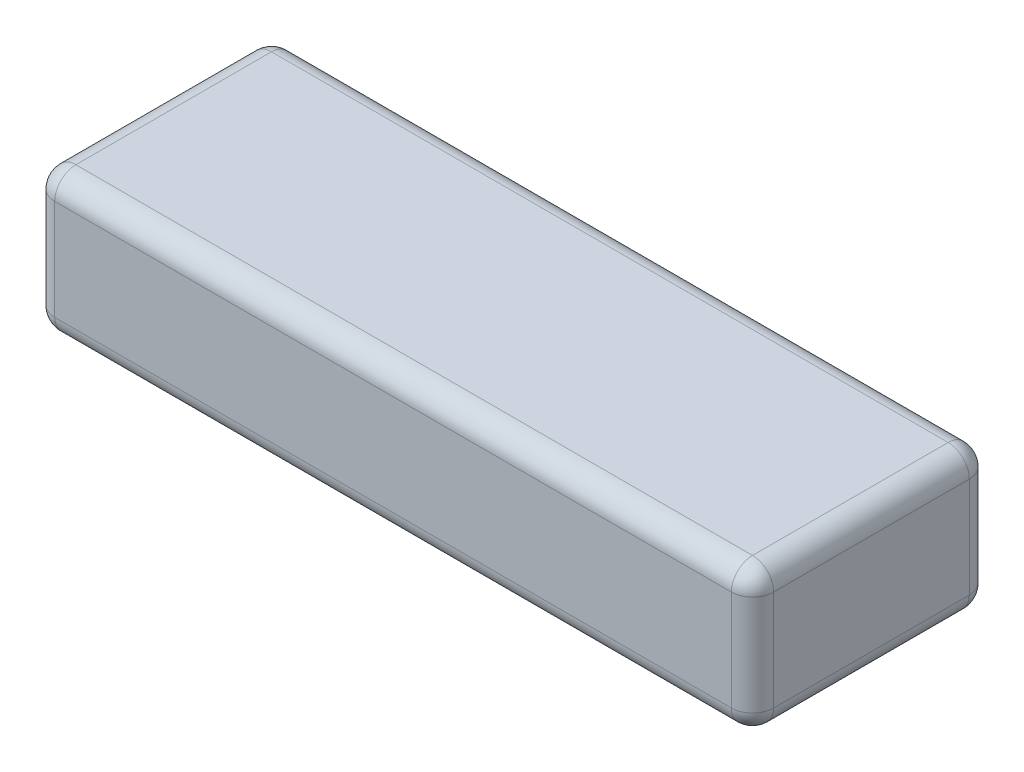
ISO-10303-21;
HEADER;
FILE_DESCRIPTION(('STEP AP214'),'2;1');
FILE_NAME('part.step','',(''),(''),'','','');
FILE_SCHEMA(('AUTOMOTIVE_DESIGN { 1 0 10303 214 1 1 1 1 }'));
ENDSEC;
DATA;
#1=APPLICATION_CONTEXT('core data for automotive mechanical design processes');
#2=APPLICATION_PROTOCOL_DEFINITION('international standard','automotive_design',2000,#1);
#3=PRODUCT_CONTEXT('',#1,'mechanical');
#4=PRODUCT('Part','Part','',(#3));
#5=PRODUCT_RELATED_PRODUCT_CATEGORY('part','',(#4));
#6=PRODUCT_DEFINITION_FORMATION('','',#4);
#7=PRODUCT_DEFINITION_CONTEXT('part definition',#1,'design');
#8=PRODUCT_DEFINITION('design','',#6,#7);
#9=PRODUCT_DEFINITION_SHAPE('','',#8);
#10=(LENGTH_UNIT() NAMED_UNIT(*) SI_UNIT(.MILLI.,.METRE.));
#11=(NAMED_UNIT(*) PLANE_ANGLE_UNIT() SI_UNIT($,.RADIAN.));
#12=(NAMED_UNIT(*) SI_UNIT($,.STERADIAN.) SOLID_ANGLE_UNIT());
#13=UNCERTAINTY_MEASURE_WITH_UNIT(LENGTH_MEASURE(1.E-05),#10,'distance_accuracy_value','');
#14=(GEOMETRIC_REPRESENTATION_CONTEXT(3) GLOBAL_UNCERTAINTY_ASSIGNED_CONTEXT((#13)) GLOBAL_UNIT_ASSIGNED_CONTEXT((#10,
#11,#12)) REPRESENTATION_CONTEXT('',''));
#15=CARTESIAN_POINT('',(0.,0.,0.));
#16=DIRECTION('',(0.,0.,1.));
#17=DIRECTION('',(1.,0.,0.));
#18=AXIS2_PLACEMENT_3D('',#15,#16,#17);
#19=CARTESIAN_POINT('',(68.,27.,22.5));
#20=DIRECTION('',(-1.,0.,0.));
#21=DIRECTION('',(0.,0.,1.));
#22=AXIS2_PLACEMENT_3D('',#19,#20,#21);
#23=PLANE('',#22);
#24=DIRECTION('',(0.,-1.,0.));
#25=VECTOR('',#24,1.);
#26=CARTESIAN_POINT('',(68.,27.,18.5));
#27=LINE('',#26,#25);
#28=CARTESIAN_POINT('',(68.,23.,18.5));
#29=VERTEX_POINT('',#28);
#30=CARTESIAN_POINT('',(68.,4.,18.5));
#31=VERTEX_POINT('',#30);
#32=EDGE_CURVE('E188',#29,#31,#27,.T.);
#33=ORIENTED_EDGE('',*,*,#32,.T.);
#34=DIRECTION('',(0.,0.,-1.));
#35=VECTOR('',#34,1.);
#36=CARTESIAN_POINT('',(68.,4.,-22.5));
#37=LINE('',#36,#35);
#38=CARTESIAN_POINT('',(68.,4.,-18.5));
#39=VERTEX_POINT('',#38);
#40=EDGE_CURVE('E191',#31,#39,#37,.T.);
#41=ORIENTED_EDGE('',*,*,#40,.T.);
#42=DIRECTION('',(0.,-1.,0.));
#43=VECTOR('',#42,1.);
#44=CARTESIAN_POINT('',(68.,27.,-18.5));
#45=LINE('',#44,#43);
#46=CARTESIAN_POINT('',(68.,23.,-18.5));
#47=VERTEX_POINT('',#46);
#48=EDGE_CURVE('E186',#39,#47,#45,.F.);
#49=ORIENTED_EDGE('',*,*,#48,.T.);
#50=DIRECTION('',(0.,0.,-1.));
#51=VECTOR('',#50,1.);
#52=CARTESIAN_POINT('',(68.,23.,22.5));
#53=LINE('',#52,#51);
#54=EDGE_CURVE('E184',#47,#29,#53,.F.);
#55=ORIENTED_EDGE('',*,*,#54,.T.);
#56=EDGE_LOOP('',(#33,#41,#49,#55));
#57=FACE_BOUND('',#56,.T.);
#58=ADVANCED_FACE('F37',(#57),#23,.F.);
#59=CARTESIAN_POINT('',(-68.,27.,-22.5));
#60=DIRECTION('',(0.,0.,1.));
#61=DIRECTION('',(1.,0.,0.));
#62=AXIS2_PLACEMENT_3D('',#59,#60,#61);
#63=PLANE('',#62);
#64=DIRECTION('',(0.,-1.,0.));
#65=VECTOR('',#64,1.);
#66=CARTESIAN_POINT('',(64.,27.,-22.5));
#67=LINE('',#66,#65);
#68=CARTESIAN_POINT('',(64.,23.,-22.5));
#69=VERTEX_POINT('',#68);
#70=CARTESIAN_POINT('',(64.,4.,-22.5));
#71=VERTEX_POINT('',#70);
#72=EDGE_CURVE('E170',#69,#71,#67,.T.);
#73=ORIENTED_EDGE('',*,*,#72,.T.);
#74=DIRECTION('',(-1.,0.,0.));
#75=VECTOR('',#74,1.);
#76=CARTESIAN_POINT('',(-68.,4.,-22.5));
#77=LINE('',#76,#75);
#78=CARTESIAN_POINT('',(-64.,4.,-22.5));
#79=VERTEX_POINT('',#78);
#80=EDGE_CURVE('E175',#71,#79,#77,.T.);
#81=ORIENTED_EDGE('',*,*,#80,.T.);
#82=DIRECTION('',(0.,-1.,0.));
#83=VECTOR('',#82,1.);
#84=CARTESIAN_POINT('',(-64.,27.,-22.5));
#85=LINE('',#84,#83);
#86=CARTESIAN_POINT('',(-64.,23.,-22.5));
#87=VERTEX_POINT('',#86);
#88=EDGE_CURVE('E172',#79,#87,#85,.F.);
#89=ORIENTED_EDGE('',*,*,#88,.T.);
#90=DIRECTION('',(-1.,0.,0.));
#91=VECTOR('',#90,1.);
#92=CARTESIAN_POINT('',(-68.,23.,-22.5));
#93=LINE('',#92,#91);
#94=EDGE_CURVE('E168',#87,#69,#93,.F.);
#95=ORIENTED_EDGE('',*,*,#94,.T.);
#96=EDGE_LOOP('',(#73,#81,#89,#95));
#97=FACE_BOUND('',#96,.T.);
#98=ADVANCED_FACE('F309',(#97),#63,.F.);
#99=CARTESIAN_POINT('',(-68.,27.,22.5));
#100=DIRECTION('',(1.,0.,0.));
#101=DIRECTION('',(0.,0.,-1.));
#102=AXIS2_PLACEMENT_3D('',#99,#100,#101);
#103=PLANE('',#102);
#104=DIRECTION('',(0.,-1.,0.));
#105=VECTOR('',#104,1.);
#106=CARTESIAN_POINT('',(-68.,27.,-18.5));
#107=LINE('',#106,#105);
#108=CARTESIAN_POINT('',(-68.,23.,-18.5));
#109=VERTEX_POINT('',#108);
#110=CARTESIAN_POINT('',(-68.,4.,-18.5));
#111=VERTEX_POINT('',#110);
#112=EDGE_CURVE('E136',#109,#111,#107,.T.);
#113=ORIENTED_EDGE('',*,*,#112,.T.);
#114=DIRECTION('',(0.,0.,1.));
#115=VECTOR('',#114,1.);
#116=CARTESIAN_POINT('',(-68.,4.,22.5));
#117=LINE('',#116,#115);
#118=CARTESIAN_POINT('',(-68.,4.,18.5));
#119=VERTEX_POINT('',#118);
#120=EDGE_CURVE('E132',#111,#119,#117,.T.);
#121=ORIENTED_EDGE('',*,*,#120,.T.);
#122=DIRECTION('',(0.,-1.,0.));
#123=VECTOR('',#122,1.);
#124=CARTESIAN_POINT('',(-68.,27.,18.5));
#125=LINE('',#124,#123);
#126=CARTESIAN_POINT('',(-68.,23.,18.5));
#127=VERTEX_POINT('',#126);
#128=EDGE_CURVE('E124',#119,#127,#125,.F.);
#129=ORIENTED_EDGE('',*,*,#128,.T.);
#130=DIRECTION('',(0.,0.,1.));
#131=VECTOR('',#130,1.);
#132=CARTESIAN_POINT('',(-68.,23.,22.5));
#133=LINE('',#132,#131);
#134=EDGE_CURVE('E129',#127,#109,#133,.F.);
#135=ORIENTED_EDGE('',*,*,#134,.T.);
#136=EDGE_LOOP('',(#113,#121,#129,#135));
#137=FACE_BOUND('',#136,.T.);
#138=ADVANCED_FACE('F127',(#137),#103,.F.);
#139=CARTESIAN_POINT('',(-68.,27.,22.5));
#140=DIRECTION('',(0.,0.,-1.));
#141=DIRECTION('',(-1.,0.,0.));
#142=AXIS2_PLACEMENT_3D('',#139,#140,#141);
#143=PLANE('',#142);
#144=DIRECTION('',(0.,-1.,0.));
#145=VECTOR('',#144,1.);
#146=CARTESIAN_POINT('',(-64.,27.,22.5));
#147=LINE('',#146,#145);
#148=CARTESIAN_POINT('',(-64.,23.,22.5));
#149=VERTEX_POINT('',#148);
#150=CARTESIAN_POINT('',(-64.,4.,22.5));
#151=VERTEX_POINT('',#150);
#152=EDGE_CURVE('E144',#149,#151,#147,.T.);
#153=ORIENTED_EDGE('',*,*,#152,.T.);
#154=DIRECTION('',(1.,0.,0.));
#155=VECTOR('',#154,1.);
#156=CARTESIAN_POINT('',(68.,4.,22.5));
#157=LINE('',#156,#155);
#158=CARTESIAN_POINT('',(64.,4.,22.5));
#159=VERTEX_POINT('',#158);
#160=EDGE_CURVE('E182',#151,#159,#157,.T.);
#161=ORIENTED_EDGE('',*,*,#160,.T.);
#162=DIRECTION('',(0.,-1.,0.));
#163=VECTOR('',#162,1.);
#164=CARTESIAN_POINT('',(64.,27.,22.5));
#165=LINE('',#164,#163);
#166=CARTESIAN_POINT('',(64.,23.,22.5));
#167=VERTEX_POINT('',#166);
#168=EDGE_CURVE('E179',#159,#167,#165,.F.);
#169=ORIENTED_EDGE('',*,*,#168,.T.);
#170=DIRECTION('',(1.,0.,0.));
#171=VECTOR('',#170,1.);
#172=CARTESIAN_POINT('',(-68.,23.,22.5));
#173=LINE('',#172,#171);
#174=EDGE_CURVE('E177',#167,#149,#173,.F.);
#175=ORIENTED_EDGE('',*,*,#174,.T.);
#176=EDGE_LOOP('',(#153,#161,#169,#175));
#177=FACE_BOUND('',#176,.T.);
#178=ADVANCED_FACE('F300',(#177),#143,.F.);
#179=CARTESIAN_POINT('',(0.,27.,0.));
#180=DIRECTION('',(0.,-1.,0.));
#181=DIRECTION('',(0.,0.,-1.));
#182=AXIS2_PLACEMENT_3D('',#179,#180,#181);
#183=PLANE('',#182);
#184=DIRECTION('',(0.,0.,1.));
#185=VECTOR('',#184,1.);
#186=CARTESIAN_POINT('',(-64.,27.,0.));
#187=LINE('',#186,#185);
#188=CARTESIAN_POINT('',(-64.,27.,-18.5));
#189=VERTEX_POINT('',#188);
#190=CARTESIAN_POINT('',(-64.,27.,18.5));
#191=VERTEX_POINT('',#190);
#192=EDGE_CURVE('E46',#189,#191,#187,.T.);
#193=ORIENTED_EDGE('',*,*,#192,.T.);
#194=DIRECTION('',(1.,0.,0.));
#195=VECTOR('',#194,1.);
#196=CARTESIAN_POINT('',(0.,27.,18.5));
#197=LINE('',#196,#195);
#198=CARTESIAN_POINT('',(64.,27.,18.5));
#199=VERTEX_POINT('',#198);
#200=EDGE_CURVE('E11',#191,#199,#197,.T.);
#201=ORIENTED_EDGE('',*,*,#200,.T.);
#202=DIRECTION('',(0.,0.,-1.));
#203=VECTOR('',#202,1.);
#204=CARTESIAN_POINT('',(64.,27.,0.));
#205=LINE('',#204,#203);
#206=CARTESIAN_POINT('',(64.,27.,-18.5));
#207=VERTEX_POINT('',#206);
#208=EDGE_CURVE('E202',#199,#207,#205,.T.);
#209=ORIENTED_EDGE('',*,*,#208,.T.);
#210=DIRECTION('',(-1.,0.,0.));
#211=VECTOR('',#210,1.);
#212=CARTESIAN_POINT('',(0.,27.,-18.5));
#213=LINE('',#212,#211);
#214=EDGE_CURVE('E57',#207,#189,#213,.T.);
#215=ORIENTED_EDGE('',*,*,#214,.T.);
#216=EDGE_LOOP('',(#193,#201,#209,#215));
#217=FACE_BOUND('',#216,.T.);
#218=ADVANCED_FACE('F302',(#217),#183,.F.);
#219=CARTESIAN_POINT('',(0.,0.,0.));
#220=DIRECTION('',(0.,-1.,0.));
#221=DIRECTION('',(0.,0.,-1.));
#222=AXIS2_PLACEMENT_3D('',#219,#220,#221);
#223=PLANE('',#222);
#224=DIRECTION('',(0.,0.,1.));
#225=VECTOR('',#224,1.);
#226=CARTESIAN_POINT('',(-64.,0.,-22.5));
#227=LINE('',#226,#225);
#228=CARTESIAN_POINT('',(-64.,0.,18.5));
#229=VERTEX_POINT('',#228);
#230=CARTESIAN_POINT('',(-64.,0.,-18.5));
#231=VERTEX_POINT('',#230);
#232=EDGE_CURVE('E197',#229,#231,#227,.F.);
#233=ORIENTED_EDGE('',*,*,#232,.T.);
#234=DIRECTION('',(-1.,0.,0.));
#235=VECTOR('',#234,1.);
#236=CARTESIAN_POINT('',(68.,0.,-18.5));
#237=LINE('',#236,#235);
#238=CARTESIAN_POINT('',(64.,0.,-18.5));
#239=VERTEX_POINT('',#238);
#240=EDGE_CURVE('E199',#231,#239,#237,.F.);
#241=ORIENTED_EDGE('',*,*,#240,.T.);
#242=DIRECTION('',(0.,0.,-1.));
#243=VECTOR('',#242,1.);
#244=CARTESIAN_POINT('',(64.,0.,22.5));
#245=LINE('',#244,#243);
#246=CARTESIAN_POINT('',(64.,0.,18.5));
#247=VERTEX_POINT('',#246);
#248=EDGE_CURVE('E193',#239,#247,#245,.F.);
#249=ORIENTED_EDGE('',*,*,#248,.T.);
#250=DIRECTION('',(1.,0.,0.));
#251=VECTOR('',#250,1.);
#252=CARTESIAN_POINT('',(-68.,0.,18.5));
#253=LINE('',#252,#251);
#254=EDGE_CURVE('E195',#247,#229,#253,.F.);
#255=ORIENTED_EDGE('',*,*,#254,.T.);
#256=EDGE_LOOP('',(#233,#241,#249,#255));
#257=FACE_BOUND('',#256,.T.);
#258=ADVANCED_FACE('F269',(#257),#223,.T.);
#259=CARTESIAN_POINT('',(64.,27.,18.5));
#260=DIRECTION('',(0.,-1.,0.));
#261=DIRECTION('',(0.,0.,-1.));
#262=AXIS2_PLACEMENT_3D('',#259,#260,#261);
#263=CYLINDRICAL_SURFACE('',#262,4.);
#264=CARTESIAN_POINT('',(64.,23.,18.5));
#265=DIRECTION('',(0.,1.,0.));
#266=DIRECTION('',(0.,0.,1.));
#267=AXIS2_PLACEMENT_3D('',#264,#265,#266);
#268=CIRCLE('',#267,4.);
#269=EDGE_CURVE('E41',#167,#29,#268,.T.);
#270=ORIENTED_EDGE('',*,*,#269,.F.);
#271=ORIENTED_EDGE('',*,*,#168,.F.);
#272=CARTESIAN_POINT('',(64.,4.,18.5));
#273=DIRECTION('',(0.,-1.,0.));
#274=DIRECTION('',(0.,0.,-1.));
#275=AXIS2_PLACEMENT_3D('',#272,#273,#274);
#276=CIRCLE('',#275,4.);
#277=EDGE_CURVE('E164',#31,#159,#276,.T.);
#278=ORIENTED_EDGE('',*,*,#277,.F.);
#279=ORIENTED_EDGE('',*,*,#32,.F.);
#280=EDGE_LOOP('',(#270,#271,#278,#279));
#281=FACE_BOUND('',#280,.T.);
#282=ADVANCED_FACE('F39',(#281),#263,.T.);
#283=CARTESIAN_POINT('',(64.,23.,18.5));
#284=DIRECTION('',(0.,0.,1.));
#285=DIRECTION('',(1.,0.,0.));
#286=AXIS2_PLACEMENT_3D('',#283,#284,#285);
#287=SPHERICAL_SURFACE('',#286,4.);
#288=CARTESIAN_POINT('',(64.,23.,18.5));
#289=DIRECTION('',(1.,0.,0.));
#290=DIRECTION('',(0.,0.,-1.));
#291=AXIS2_PLACEMENT_3D('',#288,#289,#290);
#292=CIRCLE('',#291,4.);
#293=EDGE_CURVE('E248',#167,#199,#292,.F.);
#294=ORIENTED_EDGE('',*,*,#293,.F.);
#295=ORIENTED_EDGE('',*,*,#269,.T.);
#296=CARTESIAN_POINT('',(64.,23.,18.5));
#297=DIRECTION('',(0.,0.,1.));
#298=DIRECTION('',(0.,-1.,0.));
#299=AXIS2_PLACEMENT_3D('',#296,#297,#298);
#300=CIRCLE('',#299,4.);
#301=EDGE_CURVE('E251',#199,#29,#300,.F.);
#302=ORIENTED_EDGE('',*,*,#301,.F.);
#303=EDGE_LOOP('',(#294,#295,#302));
#304=FACE_BOUND('',#303,.T.);
#305=ADVANCED_FACE('F295',(#304),#287,.T.);
#306=CARTESIAN_POINT('',(64.,4.,18.5));
#307=DIRECTION('',(0.,0.,1.));
#308=DIRECTION('',(1.,0.,0.));
#309=AXIS2_PLACEMENT_3D('',#306,#307,#308);
#310=SPHERICAL_SURFACE('',#309,4.);
#311=CARTESIAN_POINT('',(64.,4.,18.5));
#312=DIRECTION('',(0.,0.,1.));
#313=DIRECTION('',(1.,0.,0.));
#314=AXIS2_PLACEMENT_3D('',#311,#312,#313);
#315=CIRCLE('',#314,4.);
#316=EDGE_CURVE('E242',#31,#247,#315,.F.);
#317=ORIENTED_EDGE('',*,*,#316,.F.);
#318=ORIENTED_EDGE('',*,*,#277,.T.);
#319=CARTESIAN_POINT('',(64.,4.,18.5));
#320=DIRECTION('',(1.,0.,0.));
#321=DIRECTION('',(0.,0.,-1.));
#322=AXIS2_PLACEMENT_3D('',#319,#320,#321);
#323=CIRCLE('',#322,4.);
#324=EDGE_CURVE('E245',#247,#159,#323,.F.);
#325=ORIENTED_EDGE('',*,*,#324,.F.);
#326=EDGE_LOOP('',(#317,#318,#325));
#327=FACE_BOUND('',#326,.T.);
#328=ADVANCED_FACE('F258',(#327),#310,.T.);
#329=CARTESIAN_POINT('',(64.,23.,0.));
#330=DIRECTION('',(0.,0.,-1.));
#331=DIRECTION('',(-1.,0.,0.));
#332=AXIS2_PLACEMENT_3D('',#329,#330,#331);
#333=CYLINDRICAL_SURFACE('',#332,4.);
#334=ORIENTED_EDGE('',*,*,#301,.T.);
#335=ORIENTED_EDGE('',*,*,#54,.F.);
#336=CARTESIAN_POINT('',(64.,23.,-18.5));
#337=DIRECTION('',(0.,0.,-1.));
#338=DIRECTION('',(-1.,0.,0.));
#339=AXIS2_PLACEMENT_3D('',#336,#337,#338);
#340=CIRCLE('',#339,4.);
#341=EDGE_CURVE('E236',#207,#47,#340,.T.);
#342=ORIENTED_EDGE('',*,*,#341,.F.);
#343=ORIENTED_EDGE('',*,*,#208,.F.);
#344=EDGE_LOOP('',(#334,#335,#342,#343));
#345=FACE_BOUND('',#344,.T.);
#346=ADVANCED_FACE('F290',(#345),#333,.T.);
#347=CARTESIAN_POINT('',(0.,23.,18.5));
#348=DIRECTION('',(1.,0.,0.));
#349=DIRECTION('',(0.,0.,-1.));
#350=AXIS2_PLACEMENT_3D('',#347,#348,#349);
#351=CYLINDRICAL_SURFACE('',#350,4.);
#352=ORIENTED_EDGE('',*,*,#293,.T.);
#353=ORIENTED_EDGE('',*,*,#200,.F.);
#354=CARTESIAN_POINT('',(-64.,23.,18.5));
#355=DIRECTION('',(-1.,0.,0.));
#356=DIRECTION('',(0.,0.,1.));
#357=AXIS2_PLACEMENT_3D('',#354,#355,#356);
#358=CIRCLE('',#357,4.);
#359=EDGE_CURVE('E148',#149,#191,#358,.T.);
#360=ORIENTED_EDGE('',*,*,#359,.F.);
#361=ORIENTED_EDGE('',*,*,#174,.F.);
#362=EDGE_LOOP('',(#352,#353,#360,#361));
#363=FACE_BOUND('',#362,.T.);
#364=ADVANCED_FACE('F298',(#363),#351,.T.);
#365=CARTESIAN_POINT('',(-64.,27.,18.5));
#366=DIRECTION('',(0.,-1.,0.));
#367=DIRECTION('',(0.,0.,-1.));
#368=AXIS2_PLACEMENT_3D('',#365,#366,#367);
#369=CYLINDRICAL_SURFACE('',#368,4.);
#370=CARTESIAN_POINT('',(-64.,4.,18.5));
#371=DIRECTION('',(0.,-1.,0.));
#372=DIRECTION('',(0.,0.,-1.));
#373=AXIS2_PLACEMENT_3D('',#370,#371,#372);
#374=CIRCLE('',#373,4.);
#375=EDGE_CURVE('E149',#151,#119,#374,.T.);
#376=ORIENTED_EDGE('',*,*,#375,.F.);
#377=ORIENTED_EDGE('',*,*,#152,.F.);
#378=CARTESIAN_POINT('',(-64.,23.,18.5));
#379=DIRECTION('',(0.,1.,0.));
#380=DIRECTION('',(0.,0.,1.));
#381=AXIS2_PLACEMENT_3D('',#378,#379,#380);
#382=CIRCLE('',#381,4.);
#383=EDGE_CURVE('E140',#127,#149,#382,.T.);
#384=ORIENTED_EDGE('',*,*,#383,.F.);
#385=ORIENTED_EDGE('',*,*,#128,.F.);
#386=EDGE_LOOP('',(#376,#377,#384,#385));
#387=FACE_BOUND('',#386,.T.);
#388=ADVANCED_FACE('F142',(#387),#369,.T.);
#389=CARTESIAN_POINT('',(-68.,4.,18.5));
#390=DIRECTION('',(-1.,0.,0.));
#391=DIRECTION('',(0.,0.,1.));
#392=AXIS2_PLACEMENT_3D('',#389,#390,#391);
#393=CYLINDRICAL_SURFACE('',#392,4.);
#394=ORIENTED_EDGE('',*,*,#324,.T.);
#395=ORIENTED_EDGE('',*,*,#160,.F.);
#396=CARTESIAN_POINT('',(-64.,4.,18.5));
#397=DIRECTION('',(-1.,0.,0.));
#398=DIRECTION('',(0.,0.,1.));
#399=AXIS2_PLACEMENT_3D('',#396,#397,#398);
#400=CIRCLE('',#399,4.);
#401=EDGE_CURVE('E232',#229,#151,#400,.T.);
#402=ORIENTED_EDGE('',*,*,#401,.F.);
#403=ORIENTED_EDGE('',*,*,#254,.F.);
#404=EDGE_LOOP('',(#394,#395,#402,#403));
#405=FACE_BOUND('',#404,.T.);
#406=ADVANCED_FACE('F265',(#405),#393,.T.);
#407=CARTESIAN_POINT('',(64.,4.,22.5));
#408=DIRECTION('',(0.,0.,1.));
#409=DIRECTION('',(1.,0.,0.));
#410=AXIS2_PLACEMENT_3D('',#407,#408,#409);
#411=CYLINDRICAL_SURFACE('',#410,4.);
#412=ORIENTED_EDGE('',*,*,#316,.T.);
#413=ORIENTED_EDGE('',*,*,#248,.F.);
#414=CARTESIAN_POINT('',(64.,4.,-18.5));
#415=DIRECTION('',(0.,0.,-1.));
#416=DIRECTION('',(-1.,0.,0.));
#417=AXIS2_PLACEMENT_3D('',#414,#415,#416);
#418=CIRCLE('',#417,4.);
#419=EDGE_CURVE('E229',#39,#239,#418,.T.);
#420=ORIENTED_EDGE('',*,*,#419,.F.);
#421=ORIENTED_EDGE('',*,*,#40,.F.);
#422=EDGE_LOOP('',(#412,#413,#420,#421));
#423=FACE_BOUND('',#422,.T.);
#424=ADVANCED_FACE('F275',(#423),#411,.T.);
#425=CARTESIAN_POINT('',(64.,27.,-18.5));
#426=DIRECTION('',(0.,-1.,0.));
#427=DIRECTION('',(0.,0.,-1.));
#428=AXIS2_PLACEMENT_3D('',#425,#426,#427);
#429=CYLINDRICAL_SURFACE('',#428,4.);
#430=CARTESIAN_POINT('',(64.,23.,-18.5));
#431=DIRECTION('',(0.,1.,0.));
#432=DIRECTION('',(0.,0.,1.));
#433=AXIS2_PLACEMENT_3D('',#430,#431,#432);
#434=CIRCLE('',#433,4.);
#435=EDGE_CURVE('E239',#47,#69,#434,.T.);
#436=ORIENTED_EDGE('',*,*,#435,.F.);
#437=ORIENTED_EDGE('',*,*,#48,.F.);
#438=CARTESIAN_POINT('',(64.,4.,-18.5));
#439=DIRECTION('',(0.,-1.,0.));
#440=DIRECTION('',(0.,0.,-1.));
#441=AXIS2_PLACEMENT_3D('',#438,#439,#440);
#442=CIRCLE('',#441,4.);
#443=EDGE_CURVE('E226',#71,#39,#442,.T.);
#444=ORIENTED_EDGE('',*,*,#443,.F.);
#445=ORIENTED_EDGE('',*,*,#72,.F.);
#446=EDGE_LOOP('',(#436,#437,#444,#445));
#447=FACE_BOUND('',#446,.T.);
#448=ADVANCED_FACE('F282',(#447),#429,.T.);
#449=CARTESIAN_POINT('',(64.,23.,-18.5));
#450=DIRECTION('',(0.,0.,1.));
#451=DIRECTION('',(1.,0.,0.));
#452=AXIS2_PLACEMENT_3D('',#449,#450,#451);
#453=SPHERICAL_SURFACE('',#452,4.);
#454=ORIENTED_EDGE('',*,*,#341,.T.);
#455=ORIENTED_EDGE('',*,*,#435,.T.);
#456=CARTESIAN_POINT('',(64.,23.,-18.5));
#457=DIRECTION('',(1.,0.,0.));
#458=DIRECTION('',(0.,0.,-1.));
#459=AXIS2_PLACEMENT_3D('',#456,#457,#458);
#460=CIRCLE('',#459,4.);
#461=EDGE_CURVE('E155',#207,#69,#460,.F.);
#462=ORIENTED_EDGE('',*,*,#461,.F.);
#463=EDGE_LOOP('',(#454,#455,#462));
#464=FACE_BOUND('',#463,.T.);
#465=ADVANCED_FACE('F288',(#464),#453,.T.);
#466=CARTESIAN_POINT('',(-64.,23.,18.5));
#467=DIRECTION('',(0.,0.,1.));
#468=DIRECTION('',(1.,0.,0.));
#469=AXIS2_PLACEMENT_3D('',#466,#467,#468);
#470=SPHERICAL_SURFACE('',#469,4.);
#471=ORIENTED_EDGE('',*,*,#383,.T.);
#472=ORIENTED_EDGE('',*,*,#359,.T.);
#473=CARTESIAN_POINT('',(-64.,23.,18.5));
#474=DIRECTION('',(0.,0.,1.));
#475=DIRECTION('',(1.,0.,0.));
#476=AXIS2_PLACEMENT_3D('',#473,#474,#475);
#477=CIRCLE('',#476,4.);
#478=EDGE_CURVE('E152',#127,#191,#477,.F.);
#479=ORIENTED_EDGE('',*,*,#478,.F.);
#480=EDGE_LOOP('',(#471,#472,#479));
#481=FACE_BOUND('',#480,.T.);
#482=ADVANCED_FACE('F153',(#481),#470,.T.);
#483=CARTESIAN_POINT('',(-64.,4.,18.5));
#484=DIRECTION('',(0.,0.,1.));
#485=DIRECTION('',(1.,0.,0.));
#486=AXIS2_PLACEMENT_3D('',#483,#484,#485);
#487=SPHERICAL_SURFACE('',#486,4.);
#488=ORIENTED_EDGE('',*,*,#401,.T.);
#489=ORIENTED_EDGE('',*,*,#375,.T.);
#490=CARTESIAN_POINT('',(-64.,4.,18.5));
#491=DIRECTION('',(0.,0.,1.));
#492=DIRECTION('',(1.,0.,0.));
#493=AXIS2_PLACEMENT_3D('',#490,#491,#492);
#494=CIRCLE('',#493,4.);
#495=EDGE_CURVE('E156',#229,#119,#494,.F.);
#496=ORIENTED_EDGE('',*,*,#495,.F.);
#497=EDGE_LOOP('',(#488,#489,#496));
#498=FACE_BOUND('',#497,.T.);
#499=ADVANCED_FACE('F349',(#498),#487,.T.);
#500=CARTESIAN_POINT('',(64.,4.,-18.5));
#501=DIRECTION('',(0.,0.,1.));
#502=DIRECTION('',(1.,0.,0.));
#503=AXIS2_PLACEMENT_3D('',#500,#501,#502);
#504=SPHERICAL_SURFACE('',#503,4.);
#505=ORIENTED_EDGE('',*,*,#443,.T.);
#506=ORIENTED_EDGE('',*,*,#419,.T.);
#507=CARTESIAN_POINT('',(64.,4.,-18.5));
#508=DIRECTION('',(1.,0.,0.));
#509=DIRECTION('',(0.,0.,-1.));
#510=AXIS2_PLACEMENT_3D('',#507,#508,#509);
#511=CIRCLE('',#510,4.);
#512=EDGE_CURVE('E220',#71,#239,#511,.F.);
#513=ORIENTED_EDGE('',*,*,#512,.F.);
#514=EDGE_LOOP('',(#505,#506,#513));
#515=FACE_BOUND('',#514,.T.);
#516=ADVANCED_FACE('F345',(#515),#504,.T.);
#517=CARTESIAN_POINT('',(0.,23.,-18.5));
#518=DIRECTION('',(-1.,0.,0.));
#519=DIRECTION('',(0.,0.,1.));
#520=AXIS2_PLACEMENT_3D('',#517,#518,#519);
#521=CYLINDRICAL_SURFACE('',#520,4.);
#522=ORIENTED_EDGE('',*,*,#461,.T.);
#523=ORIENTED_EDGE('',*,*,#94,.F.);
#524=CARTESIAN_POINT('',(-64.,23.,-18.5));
#525=DIRECTION('',(-1.,0.,0.));
#526=DIRECTION('',(0.,0.,1.));
#527=AXIS2_PLACEMENT_3D('',#524,#525,#526);
#528=CIRCLE('',#527,4.);
#529=EDGE_CURVE('E217',#189,#87,#528,.T.);
#530=ORIENTED_EDGE('',*,*,#529,.F.);
#531=ORIENTED_EDGE('',*,*,#214,.F.);
#532=EDGE_LOOP('',(#522,#523,#530,#531));
#533=FACE_BOUND('',#532,.T.);
#534=ADVANCED_FACE('F342',(#533),#521,.T.);
#535=CARTESIAN_POINT('',(-64.,23.,0.));
#536=DIRECTION('',(0.,0.,1.));
#537=DIRECTION('',(1.,0.,0.));
#538=AXIS2_PLACEMENT_3D('',#535,#536,#537);
#539=CYLINDRICAL_SURFACE('',#538,4.);
#540=ORIENTED_EDGE('',*,*,#478,.T.);
#541=ORIENTED_EDGE('',*,*,#192,.F.);
#542=CARTESIAN_POINT('',(-64.,23.,-18.5));
#543=DIRECTION('',(0.,0.,-1.));
#544=DIRECTION('',(0.,1.,0.));
#545=AXIS2_PLACEMENT_3D('',#542,#543,#544);
#546=CIRCLE('',#545,4.);
#547=EDGE_CURVE('E160',#109,#189,#546,.T.);
#548=ORIENTED_EDGE('',*,*,#547,.F.);
#549=ORIENTED_EDGE('',*,*,#134,.F.);
#550=EDGE_LOOP('',(#540,#541,#548,#549));
#551=FACE_BOUND('',#550,.T.);
#552=ADVANCED_FACE('F158',(#551),#539,.T.);
#553=CARTESIAN_POINT('',(-64.,4.,22.5));
#554=DIRECTION('',(0.,0.,-1.));
#555=DIRECTION('',(-1.,0.,0.));
#556=AXIS2_PLACEMENT_3D('',#553,#554,#555);
#557=CYLINDRICAL_SURFACE('',#556,4.);
#558=ORIENTED_EDGE('',*,*,#495,.T.);
#559=ORIENTED_EDGE('',*,*,#120,.F.);
#560=CARTESIAN_POINT('',(-64.,4.,-18.5));
#561=DIRECTION('',(0.,0.,-1.));
#562=DIRECTION('',(-1.,0.,0.));
#563=AXIS2_PLACEMENT_3D('',#560,#561,#562);
#564=CIRCLE('',#563,4.);
#565=EDGE_CURVE('E213',#231,#111,#564,.T.);
#566=ORIENTED_EDGE('',*,*,#565,.F.);
#567=ORIENTED_EDGE('',*,*,#232,.F.);
#568=EDGE_LOOP('',(#558,#559,#566,#567));
#569=FACE_BOUND('',#568,.T.);
#570=ADVANCED_FACE('F335',(#569),#557,.T.);
#571=CARTESIAN_POINT('',(-68.,4.,-18.5));
#572=DIRECTION('',(1.,0.,0.));
#573=DIRECTION('',(0.,0.,-1.));
#574=AXIS2_PLACEMENT_3D('',#571,#572,#573);
#575=CYLINDRICAL_SURFACE('',#574,4.);
#576=ORIENTED_EDGE('',*,*,#512,.T.);
#577=ORIENTED_EDGE('',*,*,#240,.F.);
#578=CARTESIAN_POINT('',(-64.,4.,-18.5));
#579=DIRECTION('',(-1.,0.,0.));
#580=DIRECTION('',(0.,0.,1.));
#581=AXIS2_PLACEMENT_3D('',#578,#579,#580);
#582=CIRCLE('',#581,4.);
#583=EDGE_CURVE('E210',#79,#231,#582,.T.);
#584=ORIENTED_EDGE('',*,*,#583,.F.);
#585=ORIENTED_EDGE('',*,*,#80,.F.);
#586=EDGE_LOOP('',(#576,#577,#584,#585));
#587=FACE_BOUND('',#586,.T.);
#588=ADVANCED_FACE('F331',(#587),#575,.T.);
#589=CARTESIAN_POINT('',(-64.,23.,-18.5));
#590=DIRECTION('',(0.,0.,1.));
#591=DIRECTION('',(1.,0.,0.));
#592=AXIS2_PLACEMENT_3D('',#589,#590,#591);
#593=SPHERICAL_SURFACE('',#592,4.);
#594=ORIENTED_EDGE('',*,*,#547,.T.);
#595=ORIENTED_EDGE('',*,*,#529,.T.);
#596=CARTESIAN_POINT('',(-64.,23.,-18.5));
#597=DIRECTION('',(0.,1.,0.));
#598=DIRECTION('',(0.,0.,1.));
#599=AXIS2_PLACEMENT_3D('',#596,#597,#598);
#600=CIRCLE('',#599,4.);
#601=EDGE_CURVE('E208',#109,#87,#600,.F.);
#602=ORIENTED_EDGE('',*,*,#601,.F.);
#603=EDGE_LOOP('',(#594,#595,#602));
#604=FACE_BOUND('',#603,.T.);
#605=ADVANCED_FACE('F327',(#604),#593,.T.);
#606=CARTESIAN_POINT('',(-64.,4.,-18.5));
#607=DIRECTION('',(0.,0.,1.));
#608=DIRECTION('',(1.,0.,0.));
#609=AXIS2_PLACEMENT_3D('',#606,#607,#608);
#610=SPHERICAL_SURFACE('',#609,4.);
#611=ORIENTED_EDGE('',*,*,#583,.T.);
#612=ORIENTED_EDGE('',*,*,#565,.T.);
#613=CARTESIAN_POINT('',(-64.,4.,-18.5));
#614=DIRECTION('',(0.,-1.,0.));
#615=DIRECTION('',(0.,0.,-1.));
#616=AXIS2_PLACEMENT_3D('',#613,#614,#615);
#617=CIRCLE('',#616,4.);
#618=EDGE_CURVE('E206',#79,#111,#617,.F.);
#619=ORIENTED_EDGE('',*,*,#618,.F.);
#620=EDGE_LOOP('',(#611,#612,#619));
#621=FACE_BOUND('',#620,.T.);
#622=ADVANCED_FACE('F323',(#621),#610,.T.);
#623=CARTESIAN_POINT('',(-64.,27.,-18.5));
#624=DIRECTION('',(0.,-1.,0.));
#625=DIRECTION('',(0.,0.,-1.));
#626=AXIS2_PLACEMENT_3D('',#623,#624,#625);
#627=CYLINDRICAL_SURFACE('',#626,4.);
#628=ORIENTED_EDGE('',*,*,#601,.T.);
#629=ORIENTED_EDGE('',*,*,#88,.F.);
#630=ORIENTED_EDGE('',*,*,#618,.T.);
#631=ORIENTED_EDGE('',*,*,#112,.F.);
#632=EDGE_LOOP('',(#628,#629,#630,#631));
#633=FACE_BOUND('',#632,.T.);
#634=ADVANCED_FACE('F320',(#633),#627,.T.);
#635=CLOSED_SHELL('',(#58,#98,#138,#178,#218,#258,#282,#305,#328,#346,#364,#388,#406,#424,#448,
#465,#482,#499,#516,#534,#552,#570,#588,#605,#622,#634));
#636=MANIFOLD_SOLID_BREP('B2',#635);
#637=ADVANCED_BREP_SHAPE_REPRESENTATION('',(#18,#636),#14);
#638=SHAPE_DEFINITION_REPRESENTATION(#9,#637);
ENDSEC;
END-ISO-10303-21;
